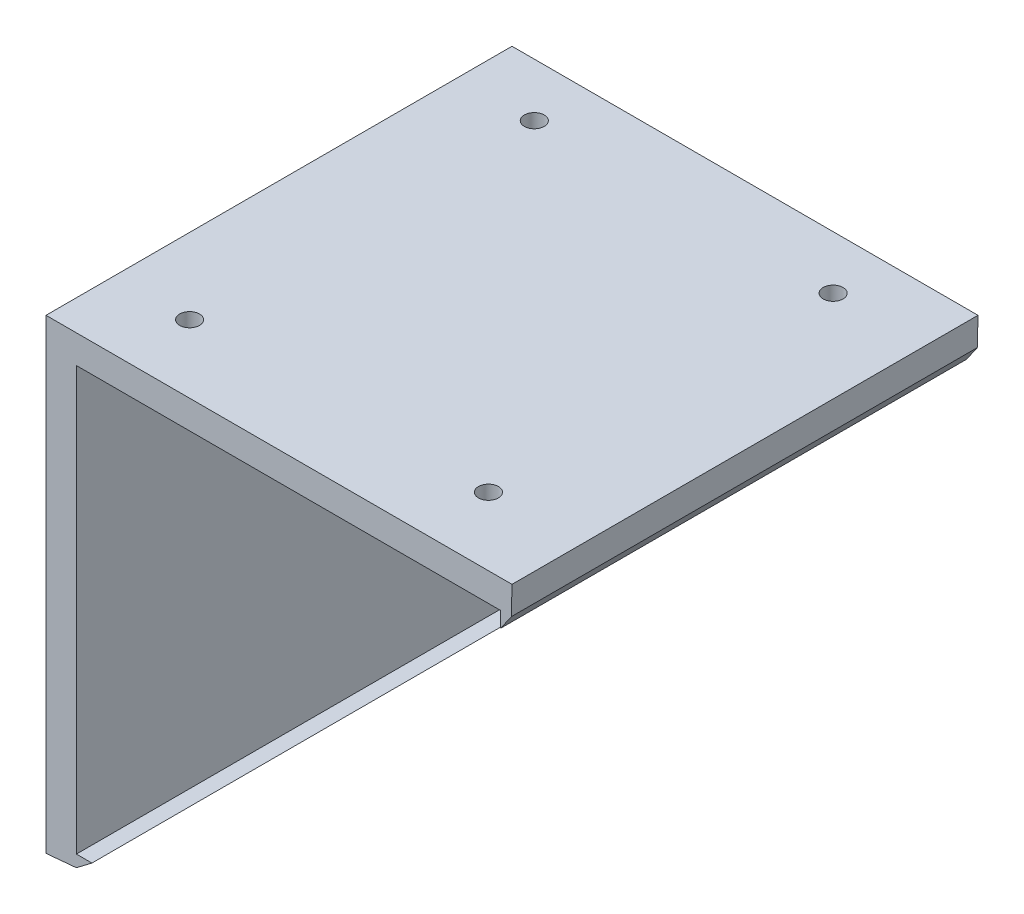
ISO-10303-21;
HEADER;
FILE_DESCRIPTION(('STEP AP214'),'2;1');
FILE_NAME('part.step','',(''),(''),'','','');
FILE_SCHEMA(('AUTOMOTIVE_DESIGN { 1 0 10303 214 1 1 1 1 }'));
ENDSEC;
DATA;
#1=APPLICATION_CONTEXT('core data for automotive mechanical design processes');
#2=APPLICATION_PROTOCOL_DEFINITION('international standard','automotive_design',2000,#1);
#3=PRODUCT_CONTEXT('',#1,'mechanical');
#4=PRODUCT('Part','Part','',(#3));
#5=PRODUCT_RELATED_PRODUCT_CATEGORY('part','',(#4));
#6=PRODUCT_DEFINITION_FORMATION('','',#4);
#7=PRODUCT_DEFINITION_CONTEXT('part definition',#1,'design');
#8=PRODUCT_DEFINITION('design','',#6,#7);
#9=PRODUCT_DEFINITION_SHAPE('','',#8);
#10=(LENGTH_UNIT() NAMED_UNIT(*) SI_UNIT(.MILLI.,.METRE.));
#11=(NAMED_UNIT(*) PLANE_ANGLE_UNIT() SI_UNIT($,.RADIAN.));
#12=(NAMED_UNIT(*) SI_UNIT($,.STERADIAN.) SOLID_ANGLE_UNIT());
#13=UNCERTAINTY_MEASURE_WITH_UNIT(LENGTH_MEASURE(1.E-05),#10,'distance_accuracy_value','');
#14=(GEOMETRIC_REPRESENTATION_CONTEXT(3) GLOBAL_UNCERTAINTY_ASSIGNED_CONTEXT((#13)) GLOBAL_UNIT_ASSIGNED_CONTEXT((#10,
#11,#12)) REPRESENTATION_CONTEXT('',''));
#15=CARTESIAN_POINT('',(0.,0.,0.));
#16=DIRECTION('',(0.,0.,1.));
#17=DIRECTION('',(1.,0.,0.));
#18=AXIS2_PLACEMENT_3D('',#15,#16,#17);
#19=CARTESIAN_POINT('',(0.,0.,30.));
#20=DIRECTION('',(0.,1.,0.));
#21=DIRECTION('',(0.,0.,1.));
#22=AXIS2_PLACEMENT_3D('',#19,#20,#21);
#23=PLANE('',#22);
#24=CARTESIAN_POINT('',(2.91019500619993,0.,25.6237816764132));
#25=DIRECTION('',(0.,1.,0.));
#26=DIRECTION('',(0.,0.,1.));
#27=AXIS2_PLACEMENT_3D('',#24,#25,#26);
#28=CIRCLE('',#27,0.640728860193898);
#29=CARTESIAN_POINT('',(2.91019500619993,0.,26.2645105366071));
#30=VERTEX_POINT('',#29);
#31=EDGE_CURVE('E274',#30,#30,#28,.T.);
#32=ORIENTED_EDGE('',*,*,#31,.T.);
#33=EDGE_LOOP('',(#32));
#34=FACE_BOUND('',#33,.T.);
#35=CARTESIAN_POINT('',(22.1478537175429,0.,3.4327936959515));
#36=DIRECTION('',(0.,1.,0.));
#37=DIRECTION('',(0.,0.,1.));
#38=AXIS2_PLACEMENT_3D('',#35,#36,#37);
#39=CIRCLE('',#38,0.640728860193898);
#40=CARTESIAN_POINT('',(22.1478537175429,0.,4.0735225561454));
#41=VERTEX_POINT('',#40);
#42=EDGE_CURVE('E275',#41,#41,#39,.T.);
#43=ORIENTED_EDGE('',*,*,#42,.T.);
#44=EDGE_LOOP('',(#43));
#45=FACE_BOUND('',#44,.T.);
#46=CARTESIAN_POINT('',(22.1478537175429,0.,25.6237816764132));
#47=DIRECTION('',(0.,1.,0.));
#48=DIRECTION('',(0.,0.,1.));
#49=AXIS2_PLACEMENT_3D('',#46,#47,#48);
#50=CIRCLE('',#49,0.640728860193897);
#51=CARTESIAN_POINT('',(22.1478537175429,0.,26.2645105366071));
#52=VERTEX_POINT('',#51);
#53=EDGE_CURVE('E279',#52,#52,#50,.T.);
#54=ORIENTED_EDGE('',*,*,#53,.T.);
#55=EDGE_LOOP('',(#54));
#56=FACE_BOUND('',#55,.T.);
#57=CARTESIAN_POINT('',(2.91019500619993,0.,3.4327936959515));
#58=DIRECTION('',(0.,1.,0.));
#59=DIRECTION('',(0.,0.,1.));
#60=AXIS2_PLACEMENT_3D('',#57,#58,#59);
#61=CIRCLE('',#60,0.640728860193899);
#62=CARTESIAN_POINT('',(2.91019500619993,0.,4.0735225561454));
#63=VERTEX_POINT('',#62);
#64=EDGE_CURVE('E213',#63,#63,#61,.T.);
#65=ORIENTED_EDGE('',*,*,#64,.T.);
#66=EDGE_LOOP('',(#65));
#67=FACE_BOUND('',#66,.T.);
#68=DIRECTION('',(1.,0.,0.));
#69=VECTOR('',#68,1.);
#70=CARTESIAN_POINT('',(0.,0.,0.));
#71=LINE('',#70,#69);
#72=CARTESIAN_POINT('',(0.,0.,0.));
#73=VERTEX_POINT('',#72);
#74=CARTESIAN_POINT('',(27.3053016648984,0.,0.));
#75=VERTEX_POINT('',#74);
#76=EDGE_CURVE('E154',#73,#75,#71,.T.);
#77=ORIENTED_EDGE('',*,*,#76,.T.);
#78=DIRECTION('',(0.,0.,-1.));
#79=VECTOR('',#78,1.);
#80=CARTESIAN_POINT('',(27.3053016648984,0.,30.));
#81=LINE('',#80,#79);
#82=CARTESIAN_POINT('',(27.3053016648984,0.,30.));
#83=VERTEX_POINT('',#82);
#84=EDGE_CURVE('E11',#83,#75,#81,.T.);
#85=ORIENTED_EDGE('',*,*,#84,.F.);
#86=DIRECTION('',(1.,0.,0.));
#87=VECTOR('',#86,1.);
#88=CARTESIAN_POINT('',(0.,0.,30.));
#89=LINE('',#88,#87);
#90=CARTESIAN_POINT('',(0.,0.,30.));
#91=VERTEX_POINT('',#90);
#92=EDGE_CURVE('E182',#91,#83,#89,.T.);
#93=ORIENTED_EDGE('',*,*,#92,.F.);
#94=DIRECTION('',(0.,0.,-1.));
#95=VECTOR('',#94,1.);
#96=CARTESIAN_POINT('',(0.,0.,30.));
#97=LINE('',#96,#95);
#98=EDGE_CURVE('E150',#91,#73,#97,.T.);
#99=ORIENTED_EDGE('',*,*,#98,.T.);
#100=EDGE_LOOP('',(#77,#85,#93,#99));
#101=FACE_BOUND('',#100,.T.);
#102=ADVANCED_FACE('F39',(#34,#45,#56,#67,#101),#23,.F.);
#103=CARTESIAN_POINT('',(27.3053016648984,0.,30.));
#104=DIRECTION('',(1.,0.,0.));
#105=DIRECTION('',(0.,0.,-1.));
#106=AXIS2_PLACEMENT_3D('',#103,#104,#105);
#107=PLANE('',#106);
#108=DIRECTION('',(0.,-1.,0.));
#109=VECTOR('',#108,1.);
#110=CARTESIAN_POINT('',(27.3053016648984,0.,0.));
#111=LINE('',#110,#109);
#112=CARTESIAN_POINT('',(27.3053016648984,-1.,0.));
#113=VERTEX_POINT('',#112);
#114=EDGE_CURVE('E158',#75,#113,#111,.T.);
#115=ORIENTED_EDGE('',*,*,#114,.T.);
#116=DIRECTION('',(0.,0.,-1.));
#117=VECTOR('',#116,1.);
#118=CARTESIAN_POINT('',(27.3053016648984,-1.,30.));
#119=LINE('',#118,#117);
#120=CARTESIAN_POINT('',(27.3053016648984,-1.,30.));
#121=VERTEX_POINT('',#120);
#122=EDGE_CURVE('E49',#121,#113,#119,.T.);
#123=ORIENTED_EDGE('',*,*,#122,.F.);
#124=DIRECTION('',(0.,-1.,0.));
#125=VECTOR('',#124,1.);
#126=CARTESIAN_POINT('',(27.3053016648984,0.,30.));
#127=LINE('',#126,#125);
#128=EDGE_CURVE('E107',#83,#121,#127,.T.);
#129=ORIENTED_EDGE('',*,*,#128,.F.);
#130=ORIENTED_EDGE('',*,*,#84,.T.);
#131=EDGE_LOOP('',(#115,#123,#129,#130));
#132=FACE_BOUND('',#131,.T.);
#133=ADVANCED_FACE('F305',(#132),#107,.F.);
#134=CARTESIAN_POINT('',(27.3053016648984,-1.,30.));
#135=DIRECTION('',(-0.821272263872015,0.570536474376999,0.));
#136=DIRECTION('',(-0.570536474376999,-0.821272263872015,0.));
#137=AXIS2_PLACEMENT_3D('',#134,#135,#136);
#138=PLANE('',#137);
#139=DIRECTION('',(0.570536474376999,0.821272263872015,0.));
#140=VECTOR('',#139,1.);
#141=CARTESIAN_POINT('',(27.3053016648984,-1.,0.));
#142=LINE('',#141,#140);
#143=CARTESIAN_POINT('',(28.,0.,0.));
#144=VERTEX_POINT('',#143);
#145=EDGE_CURVE('E161',#113,#144,#142,.T.);
#146=ORIENTED_EDGE('',*,*,#145,.T.);
#147=DIRECTION('',(0.,0.,-1.));
#148=VECTOR('',#147,1.);
#149=CARTESIAN_POINT('',(28.,0.,30.));
#150=LINE('',#149,#148);
#151=CARTESIAN_POINT('',(28.,0.,30.));
#152=VERTEX_POINT('',#151);
#153=EDGE_CURVE('E201',#152,#144,#150,.T.);
#154=ORIENTED_EDGE('',*,*,#153,.F.);
#155=DIRECTION('',(0.570536474376999,0.821272263872015,0.));
#156=VECTOR('',#155,1.);
#157=CARTESIAN_POINT('',(27.3053016648984,-1.,30.));
#158=LINE('',#157,#156);
#159=EDGE_CURVE('E264',#121,#152,#158,.T.);
#160=ORIENTED_EDGE('',*,*,#159,.F.);
#161=ORIENTED_EDGE('',*,*,#122,.T.);
#162=EDGE_LOOP('',(#146,#154,#160,#161));
#163=FACE_BOUND('',#162,.T.);
#164=ADVANCED_FACE('F310',(#163),#138,.F.);
#165=CARTESIAN_POINT('',(28.0417551377601,1.8226989558931,30.));
#166=DIRECTION('',(-0.999737705574449,0.0229024027721232,0.));
#167=DIRECTION('',(-0.0229024027721232,-0.999737705574449,0.));
#168=AXIS2_PLACEMENT_3D('',#165,#166,#167);
#169=PLANE('',#168);
#170=DIRECTION('',(0.0229024027721232,0.999737705574449,0.));
#171=VECTOR('',#170,1.);
#172=CARTESIAN_POINT('',(28.0417551377601,1.8226989558931,0.));
#173=LINE('',#172,#171);
#174=CARTESIAN_POINT('',(28.0417551377601,1.8226989558931,0.));
#175=VERTEX_POINT('',#174);
#176=EDGE_CURVE('E164',#144,#175,#173,.T.);
#177=ORIENTED_EDGE('',*,*,#176,.T.);
#178=DIRECTION('',(0.,0.,-1.));
#179=VECTOR('',#178,1.);
#180=CARTESIAN_POINT('',(28.0417551377601,1.8226989558931,30.));
#181=LINE('',#180,#179);
#182=CARTESIAN_POINT('',(28.0417551377601,1.8226989558931,30.));
#183=VERTEX_POINT('',#182);
#184=EDGE_CURVE('E197',#183,#175,#181,.T.);
#185=ORIENTED_EDGE('',*,*,#184,.F.);
#186=DIRECTION('',(0.0229024027721232,0.999737705574449,0.));
#187=VECTOR('',#186,1.);
#188=CARTESIAN_POINT('',(28.0417551377601,1.8226989558931,30.));
#189=LINE('',#188,#187);
#190=EDGE_CURVE('E261',#152,#183,#189,.T.);
#191=ORIENTED_EDGE('',*,*,#190,.F.);
#192=ORIENTED_EDGE('',*,*,#153,.T.);
#193=EDGE_LOOP('',(#177,#185,#191,#192));
#194=FACE_BOUND('',#193,.T.);
#195=ADVANCED_FACE('F231',(#194),#169,.F.);
#196=CARTESIAN_POINT('',(28.0417551377601,1.8226989558931,30.));
#197=DIRECTION('',(0.,-1.,0.));
#198=DIRECTION('',(1.,0.,0.));
#199=AXIS2_PLACEMENT_3D('',#196,#197,#198);
#200=PLANE('',#199);
#201=CARTESIAN_POINT('',(2.91019500619993,1.82269895589309,25.6237816764132));
#202=DIRECTION('',(0.,-1.,0.));
#203=DIRECTION('',(1.,0.,0.));
#204=AXIS2_PLACEMENT_3D('',#201,#202,#203);
#205=CIRCLE('',#204,0.640728860193898);
#206=CARTESIAN_POINT('',(3.55092386639382,1.82269895589309,25.6237816764132));
#207=VERTEX_POINT('',#206);
#208=EDGE_CURVE('E42',#207,#207,#205,.F.);
#209=ORIENTED_EDGE('',*,*,#208,.F.);
#210=EDGE_LOOP('',(#209));
#211=FACE_BOUND('',#210,.T.);
#212=CARTESIAN_POINT('',(22.1478537175429,1.8226989558931,3.4327936959515));
#213=DIRECTION('',(0.,-1.,0.));
#214=DIRECTION('',(1.,0.,0.));
#215=AXIS2_PLACEMENT_3D('',#212,#213,#214);
#216=CIRCLE('',#215,0.640728860193898);
#217=CARTESIAN_POINT('',(22.7885825777368,1.8226989558931,3.4327936959515));
#218=VERTEX_POINT('',#217);
#219=EDGE_CURVE('E216',#218,#218,#216,.F.);
#220=ORIENTED_EDGE('',*,*,#219,.F.);
#221=EDGE_LOOP('',(#220));
#222=FACE_BOUND('',#221,.T.);
#223=CARTESIAN_POINT('',(22.1478537175429,1.8226989558931,25.6237816764132));
#224=DIRECTION('',(0.,-1.,0.));
#225=DIRECTION('',(1.,0.,0.));
#226=AXIS2_PLACEMENT_3D('',#223,#224,#225);
#227=CIRCLE('',#226,0.640728860193897);
#228=CARTESIAN_POINT('',(22.7885825777368,1.8226989558931,25.6237816764132));
#229=VERTEX_POINT('',#228);
#230=EDGE_CURVE('E212',#229,#229,#227,.F.);
#231=ORIENTED_EDGE('',*,*,#230,.F.);
#232=EDGE_LOOP('',(#231));
#233=FACE_BOUND('',#232,.T.);
#234=CARTESIAN_POINT('',(2.91019500619993,1.82269895589309,3.4327936959515));
#235=DIRECTION('',(0.,-1.,0.));
#236=DIRECTION('',(1.,0.,0.));
#237=AXIS2_PLACEMENT_3D('',#234,#235,#236);
#238=CIRCLE('',#237,0.640728860193899);
#239=CARTESIAN_POINT('',(3.55092386639383,1.82269895589309,3.4327936959515));
#240=VERTEX_POINT('',#239);
#241=EDGE_CURVE('E208',#240,#240,#238,.F.);
#242=ORIENTED_EDGE('',*,*,#241,.F.);
#243=EDGE_LOOP('',(#242));
#244=FACE_BOUND('',#243,.T.);
#245=DIRECTION('',(-1.,0.,0.));
#246=VECTOR('',#245,1.);
#247=CARTESIAN_POINT('',(28.0417551377601,1.8226989558931,0.));
#248=LINE('',#247,#246);
#249=CARTESIAN_POINT('',(-1.95824486223993,1.82269895589309,0.));
#250=VERTEX_POINT('',#249);
#251=EDGE_CURVE('E167',#175,#250,#248,.T.);
#252=ORIENTED_EDGE('',*,*,#251,.T.);
#253=DIRECTION('',(0.,0.,-1.));
#254=VECTOR('',#253,1.);
#255=CARTESIAN_POINT('',(-1.95824486223993,1.82269895589309,30.));
#256=LINE('',#255,#254);
#257=CARTESIAN_POINT('',(-1.95824486223993,1.82269895589309,30.));
#258=VERTEX_POINT('',#257);
#259=EDGE_CURVE('E193',#258,#250,#256,.T.);
#260=ORIENTED_EDGE('',*,*,#259,.F.);
#261=DIRECTION('',(-1.,0.,0.));
#262=VECTOR('',#261,1.);
#263=CARTESIAN_POINT('',(28.0417551377601,1.8226989558931,30.));
#264=LINE('',#263,#262);
#265=EDGE_CURVE('E256',#183,#258,#264,.T.);
#266=ORIENTED_EDGE('',*,*,#265,.F.);
#267=ORIENTED_EDGE('',*,*,#184,.T.);
#268=EDGE_LOOP('',(#252,#260,#266,#267));
#269=FACE_BOUND('',#268,.T.);
#270=ADVANCED_FACE('F227',(#211,#222,#233,#244,#269),#200,.F.);
#271=CARTESIAN_POINT('',(-1.95824486223993,1.82269895589309,30.));
#272=DIRECTION('',(1.,0.,0.));
#273=DIRECTION('',(0.,1.,0.));
#274=AXIS2_PLACEMENT_3D('',#271,#272,#273);
#275=PLANE('',#274);
#276=DIRECTION('',(0.,-1.,0.));
#277=VECTOR('',#276,1.);
#278=CARTESIAN_POINT('',(-1.95824486223993,1.82269895589309,0.));
#279=LINE('',#278,#277);
#280=CARTESIAN_POINT('',(-1.95824486223993,-28.1773010441069,0.));
#281=VERTEX_POINT('',#280);
#282=EDGE_CURVE('E170',#250,#281,#279,.T.);
#283=ORIENTED_EDGE('',*,*,#282,.T.);
#284=DIRECTION('',(0.,0.,-1.));
#285=VECTOR('',#284,1.);
#286=CARTESIAN_POINT('',(-1.95824486223993,-28.1773010441069,30.));
#287=LINE('',#286,#285);
#288=CARTESIAN_POINT('',(-1.95824486223993,-28.1773010441069,30.));
#289=VERTEX_POINT('',#288);
#290=EDGE_CURVE('E189',#289,#281,#287,.T.);
#291=ORIENTED_EDGE('',*,*,#290,.F.);
#292=DIRECTION('',(0.,-1.,0.));
#293=VECTOR('',#292,1.);
#294=CARTESIAN_POINT('',(-1.95824486223993,1.82269895589309,30.));
#295=LINE('',#294,#293);
#296=EDGE_CURVE('E248',#258,#289,#295,.T.);
#297=ORIENTED_EDGE('',*,*,#296,.F.);
#298=ORIENTED_EDGE('',*,*,#259,.T.);
#299=EDGE_LOOP('',(#283,#291,#297,#298));
#300=FACE_BOUND('',#299,.T.);
#301=ADVANCED_FACE('F230',(#300),#275,.F.);
#302=CARTESIAN_POINT('',(-1.95824486223993,-28.1773010441069,30.));
#303=DIRECTION('',(-0.09017194969979,0.9959262118688,0.));
#304=DIRECTION('',(-0.9959262118688,-0.0901719496997901,0.));
#305=AXIS2_PLACEMENT_3D('',#302,#303,#304);
#306=PLANE('',#305);
#307=DIRECTION('',(0.9959262118688,0.09017194969979,0.));
#308=VECTOR('',#307,1.);
#309=CARTESIAN_POINT('',(-1.95824486223993,-28.1773010441069,0.));
#310=LINE('',#309,#308);
#311=CARTESIAN_POINT('',(0.,-28.,0.));
#312=VERTEX_POINT('',#311);
#313=EDGE_CURVE('E173',#281,#312,#310,.T.);
#314=ORIENTED_EDGE('',*,*,#313,.T.);
#315=DIRECTION('',(0.,0.,-1.));
#316=VECTOR('',#315,1.);
#317=CARTESIAN_POINT('',(0.,-28.,30.));
#318=LINE('',#317,#316);
#319=CARTESIAN_POINT('',(0.,-28.,30.));
#320=VERTEX_POINT('',#319);
#321=EDGE_CURVE('E143',#320,#312,#318,.T.);
#322=ORIENTED_EDGE('',*,*,#321,.F.);
#323=DIRECTION('',(0.9959262118688,0.09017194969979,0.));
#324=VECTOR('',#323,1.);
#325=CARTESIAN_POINT('',(-1.95824486223993,-28.1773010441069,30.));
#326=LINE('',#325,#324);
#327=EDGE_CURVE('E132',#289,#320,#326,.T.);
#328=ORIENTED_EDGE('',*,*,#327,.F.);
#329=ORIENTED_EDGE('',*,*,#290,.T.);
#330=EDGE_LOOP('',(#314,#322,#328,#329));
#331=FACE_BOUND('',#330,.T.);
#332=ADVANCED_FACE('F253',(#331),#306,.F.);
#333=CARTESIAN_POINT('',(0.,-28.,30.));
#334=DIRECTION('',(-0.606565926966108,0.795033191913235,0.));
#335=DIRECTION('',(-0.795033191913235,-0.606565926966108,0.));
#336=AXIS2_PLACEMENT_3D('',#333,#334,#335);
#337=PLANE('',#336);
#338=DIRECTION('',(0.795033191913235,0.606565926966108,0.));
#339=VECTOR('',#338,1.);
#340=CARTESIAN_POINT('',(0.,-28.,0.));
#341=LINE('',#340,#339);
#342=CARTESIAN_POINT('',(1.,-27.2370558447926,0.));
#343=VERTEX_POINT('',#342);
#344=EDGE_CURVE('E141',#312,#343,#341,.T.);
#345=ORIENTED_EDGE('',*,*,#344,.T.);
#346=DIRECTION('',(0.,0.,-1.));
#347=VECTOR('',#346,1.);
#348=CARTESIAN_POINT('',(1.,-27.2370558447926,30.));
#349=LINE('',#348,#347);
#350=CARTESIAN_POINT('',(1.,-27.2370558447926,30.));
#351=VERTEX_POINT('',#350);
#352=EDGE_CURVE('E138',#351,#343,#349,.T.);
#353=ORIENTED_EDGE('',*,*,#352,.F.);
#354=DIRECTION('',(0.795033191913235,0.606565926966108,0.));
#355=VECTOR('',#354,1.);
#356=CARTESIAN_POINT('',(0.,-28.,30.));
#357=LINE('',#356,#355);
#358=EDGE_CURVE('E126',#320,#351,#357,.T.);
#359=ORIENTED_EDGE('',*,*,#358,.F.);
#360=ORIENTED_EDGE('',*,*,#321,.T.);
#361=EDGE_LOOP('',(#345,#353,#359,#360));
#362=FACE_BOUND('',#361,.T.);
#363=ADVANCED_FACE('F139',(#362),#337,.F.);
#364=CARTESIAN_POINT('',(0.,-27.2370558447926,30.));
#365=DIRECTION('',(0.,-1.,0.));
#366=DIRECTION('',(0.,0.,-1.));
#367=AXIS2_PLACEMENT_3D('',#364,#365,#366);
#368=PLANE('',#367);
#369=DIRECTION('',(-1.,0.,0.));
#370=VECTOR('',#369,1.);
#371=CARTESIAN_POINT('',(0.,-27.2370558447926,0.));
#372=LINE('',#371,#370);
#373=CARTESIAN_POINT('',(0.,-27.2370558447926,0.));
#374=VERTEX_POINT('',#373);
#375=EDGE_CURVE('E93',#343,#374,#372,.T.);
#376=ORIENTED_EDGE('',*,*,#375,.T.);
#377=DIRECTION('',(0.,0.,-1.));
#378=VECTOR('',#377,1.);
#379=CARTESIAN_POINT('',(0.,-27.2370558447926,30.));
#380=LINE('',#379,#378);
#381=CARTESIAN_POINT('',(0.,-27.2370558447926,30.));
#382=VERTEX_POINT('',#381);
#383=EDGE_CURVE('E144',#382,#374,#380,.T.);
#384=ORIENTED_EDGE('',*,*,#383,.F.);
#385=DIRECTION('',(-1.,0.,0.));
#386=VECTOR('',#385,1.);
#387=CARTESIAN_POINT('',(0.,-27.2370558447926,30.));
#388=LINE('',#387,#386);
#389=EDGE_CURVE('E130',#351,#382,#388,.T.);
#390=ORIENTED_EDGE('',*,*,#389,.F.);
#391=ORIENTED_EDGE('',*,*,#352,.T.);
#392=EDGE_LOOP('',(#376,#384,#390,#391));
#393=FACE_BOUND('',#392,.T.);
#394=ADVANCED_FACE('F146',(#393),#368,.F.);
#395=CARTESIAN_POINT('',(0.,0.,30.));
#396=DIRECTION('',(-1.,0.,0.));
#397=DIRECTION('',(0.,0.,1.));
#398=AXIS2_PLACEMENT_3D('',#395,#396,#397);
#399=PLANE('',#398);
#400=DIRECTION('',(0.,1.,0.));
#401=VECTOR('',#400,1.);
#402=CARTESIAN_POINT('',(0.,0.,0.));
#403=LINE('',#402,#401);
#404=EDGE_CURVE('E99',#374,#73,#403,.T.);
#405=ORIENTED_EDGE('',*,*,#404,.T.);
#406=ORIENTED_EDGE('',*,*,#98,.F.);
#407=DIRECTION('',(0.,1.,0.));
#408=VECTOR('',#407,1.);
#409=CARTESIAN_POINT('',(0.,0.,30.));
#410=LINE('',#409,#408);
#411=EDGE_CURVE('E58',#382,#91,#410,.T.);
#412=ORIENTED_EDGE('',*,*,#411,.F.);
#413=ORIENTED_EDGE('',*,*,#383,.T.);
#414=EDGE_LOOP('',(#405,#406,#412,#413));
#415=FACE_BOUND('',#414,.T.);
#416=ADVANCED_FACE('F321',(#415),#399,.F.);
#417=CARTESIAN_POINT('',(0.,0.,30.));
#418=DIRECTION('',(0.,0.,-1.));
#419=DIRECTION('',(-1.,0.,0.));
#420=AXIS2_PLACEMENT_3D('',#417,#418,#419);
#421=PLANE('',#420);
#422=ORIENTED_EDGE('',*,*,#92,.T.);
#423=ORIENTED_EDGE('',*,*,#128,.T.);
#424=ORIENTED_EDGE('',*,*,#159,.T.);
#425=ORIENTED_EDGE('',*,*,#190,.T.);
#426=ORIENTED_EDGE('',*,*,#265,.T.);
#427=ORIENTED_EDGE('',*,*,#296,.T.);
#428=ORIENTED_EDGE('',*,*,#327,.T.);
#429=ORIENTED_EDGE('',*,*,#358,.T.);
#430=ORIENTED_EDGE('',*,*,#389,.T.);
#431=ORIENTED_EDGE('',*,*,#411,.T.);
#432=EDGE_LOOP('',(#422,#423,#424,#425,#426,#427,#428,#429,#430,#431));
#433=FACE_BOUND('',#432,.T.);
#434=ADVANCED_FACE('F128',(#433),#421,.F.);
#435=CARTESIAN_POINT('',(0.,0.,0.));
#436=DIRECTION('',(0.,0.,-1.));
#437=DIRECTION('',(-1.,0.,0.));
#438=AXIS2_PLACEMENT_3D('',#435,#436,#437);
#439=PLANE('',#438);
#440=ORIENTED_EDGE('',*,*,#76,.F.);
#441=ORIENTED_EDGE('',*,*,#404,.F.);
#442=ORIENTED_EDGE('',*,*,#375,.F.);
#443=ORIENTED_EDGE('',*,*,#344,.F.);
#444=ORIENTED_EDGE('',*,*,#313,.F.);
#445=ORIENTED_EDGE('',*,*,#282,.F.);
#446=ORIENTED_EDGE('',*,*,#251,.F.);
#447=ORIENTED_EDGE('',*,*,#176,.F.);
#448=ORIENTED_EDGE('',*,*,#145,.F.);
#449=ORIENTED_EDGE('',*,*,#114,.F.);
#450=EDGE_LOOP('',(#440,#441,#442,#443,#444,#445,#446,#447,#448,#449));
#451=FACE_BOUND('',#450,.T.);
#452=ADVANCED_FACE('F251',(#451),#439,.T.);
#453=CARTESIAN_POINT('',(2.91019500619993,7.,3.4327936959515));
#454=DIRECTION('',(0.,-1.,0.));
#455=DIRECTION('',(0.,0.,-1.));
#456=AXIS2_PLACEMENT_3D('',#453,#454,#455);
#457=CYLINDRICAL_SURFACE('',#456,0.640728860193899);
#458=ORIENTED_EDGE('',*,*,#64,.F.);
#459=EDGE_LOOP('',(#458));
#460=FACE_BOUND('',#459,.T.);
#461=ORIENTED_EDGE('',*,*,#241,.T.);
#462=EDGE_LOOP('',(#461));
#463=FACE_BOUND('',#462,.T.);
#464=ADVANCED_FACE('F293',(#460,#463),#457,.F.);
#465=CARTESIAN_POINT('',(22.1478537175429,7.,25.6237816764132));
#466=DIRECTION('',(0.,-1.,0.));
#467=DIRECTION('',(0.,0.,-1.));
#468=AXIS2_PLACEMENT_3D('',#465,#466,#467);
#469=CYLINDRICAL_SURFACE('',#468,0.640728860193897);
#470=ORIENTED_EDGE('',*,*,#53,.F.);
#471=EDGE_LOOP('',(#470));
#472=FACE_BOUND('',#471,.T.);
#473=ORIENTED_EDGE('',*,*,#230,.T.);
#474=EDGE_LOOP('',(#473));
#475=FACE_BOUND('',#474,.T.);
#476=ADVANCED_FACE('F289',(#472,#475),#469,.F.);
#477=CARTESIAN_POINT('',(22.1478537175429,7.,3.4327936959515));
#478=DIRECTION('',(0.,-1.,0.));
#479=DIRECTION('',(0.,0.,-1.));
#480=AXIS2_PLACEMENT_3D('',#477,#478,#479);
#481=CYLINDRICAL_SURFACE('',#480,0.640728860193898);
#482=ORIENTED_EDGE('',*,*,#42,.F.);
#483=EDGE_LOOP('',(#482));
#484=FACE_BOUND('',#483,.T.);
#485=ORIENTED_EDGE('',*,*,#219,.T.);
#486=EDGE_LOOP('',(#485));
#487=FACE_BOUND('',#486,.T.);
#488=ADVANCED_FACE('F292',(#484,#487),#481,.F.);
#489=CARTESIAN_POINT('',(2.91019500619993,7.,25.6237816764132));
#490=DIRECTION('',(0.,-1.,0.));
#491=DIRECTION('',(0.,0.,-1.));
#492=AXIS2_PLACEMENT_3D('',#489,#490,#491);
#493=CYLINDRICAL_SURFACE('',#492,0.640728860193898);
#494=ORIENTED_EDGE('',*,*,#31,.F.);
#495=EDGE_LOOP('',(#494));
#496=FACE_BOUND('',#495,.T.);
#497=ORIENTED_EDGE('',*,*,#208,.T.);
#498=EDGE_LOOP('',(#497));
#499=FACE_BOUND('',#498,.T.);
#500=ADVANCED_FACE('F225',(#496,#499),#493,.F.);
#501=CLOSED_SHELL('',(#102,#133,#164,#195,#270,#301,#332,#363,#394,#416,#434,#452,#464,#476,
#488,#500));
#502=MANIFOLD_SOLID_BREP('B2',#501);
#503=ADVANCED_BREP_SHAPE_REPRESENTATION('',(#18,#502),#14);
#504=SHAPE_DEFINITION_REPRESENTATION(#9,#503);
ENDSEC;
END-ISO-10303-21;
